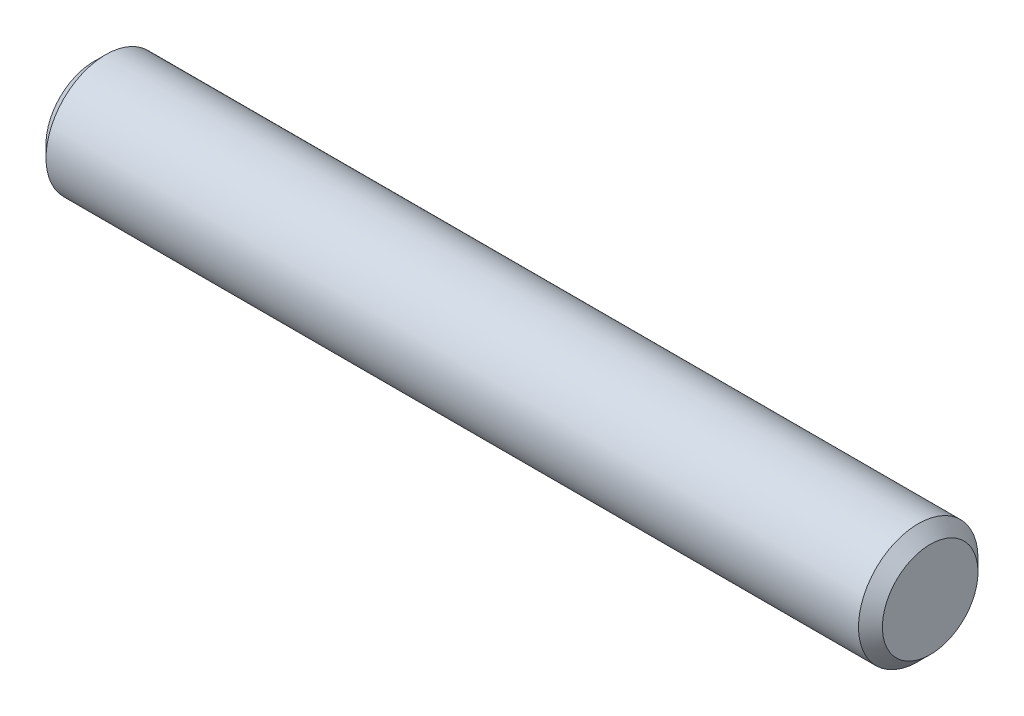
ISO-10303-21;
HEADER;
FILE_DESCRIPTION(('STEP AP214'),'2;1');
FILE_NAME('part.step','',(''),(''),'','','');
FILE_SCHEMA(('AUTOMOTIVE_DESIGN { 1 0 10303 214 1 1 1 1 }'));
ENDSEC;
DATA;
#1=APPLICATION_CONTEXT('core data for automotive mechanical design processes');
#2=APPLICATION_PROTOCOL_DEFINITION('international standard','automotive_design',2000,#1);
#3=PRODUCT_CONTEXT('',#1,'mechanical');
#4=PRODUCT('Part','Part','',(#3));
#5=PRODUCT_RELATED_PRODUCT_CATEGORY('part','',(#4));
#6=PRODUCT_DEFINITION_FORMATION('','',#4);
#7=PRODUCT_DEFINITION_CONTEXT('part definition',#1,'design');
#8=PRODUCT_DEFINITION('design','',#6,#7);
#9=PRODUCT_DEFINITION_SHAPE('','',#8);
#10=(LENGTH_UNIT() NAMED_UNIT(*) SI_UNIT(.MILLI.,.METRE.));
#11=(NAMED_UNIT(*) PLANE_ANGLE_UNIT() SI_UNIT($,.RADIAN.));
#12=(NAMED_UNIT(*) SI_UNIT($,.STERADIAN.) SOLID_ANGLE_UNIT());
#13=UNCERTAINTY_MEASURE_WITH_UNIT(LENGTH_MEASURE(1.E-05),#10,'distance_accuracy_value','');
#14=(GEOMETRIC_REPRESENTATION_CONTEXT(3) GLOBAL_UNCERTAINTY_ASSIGNED_CONTEXT((#13)) GLOBAL_UNIT_ASSIGNED_CONTEXT((#10,
#11,#12)) REPRESENTATION_CONTEXT('',''));
#15=CARTESIAN_POINT('',(0.,0.,0.));
#16=DIRECTION('',(0.,0.,1.));
#17=DIRECTION('',(1.,0.,0.));
#18=AXIS2_PLACEMENT_3D('',#15,#16,#17);
#19=CARTESIAN_POINT('',(-11.1125,0.,0.));
#20=DIRECTION('',(1.,0.,0.));
#21=DIRECTION('',(0.,0.,-1.));
#22=AXIS2_PLACEMENT_3D('',#19,#20,#21);
#23=CYLINDRICAL_SURFACE('',#22,1.5875);
#24=CARTESIAN_POINT('',(10.795,0.,0.));
#25=DIRECTION('',(1.,0.,0.));
#26=DIRECTION('',(0.,0.,-1.));
#27=AXIS2_PLACEMENT_3D('',#24,#25,#26);
#28=CIRCLE('',#27,1.5875);
#29=CARTESIAN_POINT('',(10.795,0.,-1.5875));
#30=VERTEX_POINT('',#29);
#31=EDGE_CURVE('E38',#30,#30,#28,.F.);
#32=ORIENTED_EDGE('',*,*,#31,.T.);
#33=EDGE_LOOP('',(#32));
#34=FACE_BOUND('',#33,.T.);
#35=CARTESIAN_POINT('',(-10.795,0.,0.));
#36=DIRECTION('',(1.,0.,0.));
#37=DIRECTION('',(0.,0.,-1.));
#38=AXIS2_PLACEMENT_3D('',#35,#36,#37);
#39=CIRCLE('',#38,1.5875);
#40=CARTESIAN_POINT('',(-10.795,0.,-1.5875));
#41=VERTEX_POINT('',#40);
#42=EDGE_CURVE('E42',#41,#41,#39,.T.);
#43=ORIENTED_EDGE('',*,*,#42,.T.);
#44=EDGE_LOOP('',(#43));
#45=FACE_BOUND('',#44,.T.);
#46=ADVANCED_FACE('F31',(#34,#45),#23,.T.);
#47=CARTESIAN_POINT('',(-11.1125,0.,0.));
#48=DIRECTION('',(1.,0.,0.));
#49=DIRECTION('',(0.,0.,-1.));
#50=AXIS2_PLACEMENT_3D('',#47,#48,#49);
#51=PLANE('',#50);
#52=CARTESIAN_POINT('',(-11.1125,0.,0.));
#53=DIRECTION('',(1.,0.,0.));
#54=DIRECTION('',(0.,0.,-1.));
#55=AXIS2_PLACEMENT_3D('',#52,#53,#54);
#56=CIRCLE('',#55,1.27);
#57=CARTESIAN_POINT('',(-11.1125,0.,-1.27));
#58=VERTEX_POINT('',#57);
#59=EDGE_CURVE('E10',#58,#58,#56,.F.);
#60=ORIENTED_EDGE('',*,*,#59,.T.);
#61=EDGE_LOOP('',(#60));
#62=FACE_BOUND('',#61,.T.);
#63=ADVANCED_FACE('F62',(#62),#51,.F.);
#64=CARTESIAN_POINT('',(11.1125,0.,0.));
#65=DIRECTION('',(1.,0.,0.));
#66=DIRECTION('',(0.,0.,-1.));
#67=AXIS2_PLACEMENT_3D('',#64,#65,#66);
#68=PLANE('',#67);
#69=CARTESIAN_POINT('',(11.1125,0.,0.));
#70=DIRECTION('',(1.,0.,0.));
#71=DIRECTION('',(0.,0.,-1.));
#72=AXIS2_PLACEMENT_3D('',#69,#70,#71);
#73=CIRCLE('',#72,1.27);
#74=CARTESIAN_POINT('',(11.1125,0.,-1.27));
#75=VERTEX_POINT('',#74);
#76=EDGE_CURVE('E46',#75,#75,#73,.T.);
#77=ORIENTED_EDGE('',*,*,#76,.T.);
#78=EDGE_LOOP('',(#77));
#79=FACE_BOUND('',#78,.T.);
#80=ADVANCED_FACE('F52',(#79),#68,.T.);
#81=CARTESIAN_POINT('',(11.1125,0.,0.));
#82=DIRECTION('',(-1.,0.,0.));
#83=DIRECTION('',(0.,0.,1.));
#84=AXIS2_PLACEMENT_3D('',#81,#82,#83);
#85=CONICAL_SURFACE('',#84,1.27,0.785398163397456);
#86=ORIENTED_EDGE('',*,*,#31,.F.);
#87=EDGE_LOOP('',(#86));
#88=FACE_BOUND('',#87,.T.);
#89=ORIENTED_EDGE('',*,*,#76,.F.);
#90=EDGE_LOOP('',(#89));
#91=FACE_BOUND('',#90,.T.);
#92=ADVANCED_FACE('F54',(#88,#91),#85,.T.);
#93=CARTESIAN_POINT('',(-10.795,0.,0.));
#94=DIRECTION('',(1.,0.,0.));
#95=DIRECTION('',(0.,0.,-1.));
#96=AXIS2_PLACEMENT_3D('',#93,#94,#95);
#97=CONICAL_SURFACE('',#96,1.5875,0.78539816339745);
#98=ORIENTED_EDGE('',*,*,#59,.F.);
#99=EDGE_LOOP('',(#98));
#100=FACE_BOUND('',#99,.T.);
#101=ORIENTED_EDGE('',*,*,#42,.F.);
#102=EDGE_LOOP('',(#101));
#103=FACE_BOUND('',#102,.T.);
#104=ADVANCED_FACE('F33',(#100,#103),#97,.T.);
#105=CLOSED_SHELL('',(#46,#63,#80,#92,#104));
#106=MANIFOLD_SOLID_BREP('B2',#105);
#107=ADVANCED_BREP_SHAPE_REPRESENTATION('',(#18,#106),#14);
#108=SHAPE_DEFINITION_REPRESENTATION(#9,#107);
ENDSEC;
END-ISO-10303-21;
